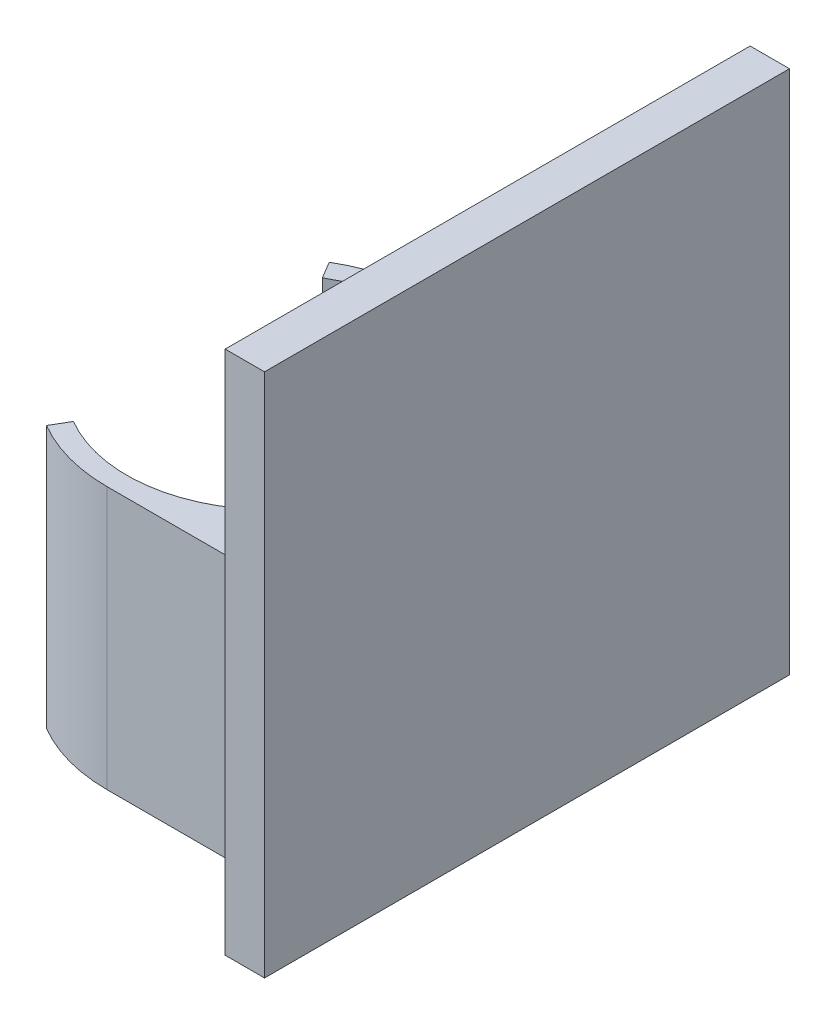
ISO-10303-21;
HEADER;
FILE_DESCRIPTION(('STEP AP214'),'2;1');
FILE_NAME('part.step','',(''),(''),'','','');
FILE_SCHEMA(('AUTOMOTIVE_DESIGN { 1 0 10303 214 1 1 1 1 }'));
ENDSEC;
DATA;
#1=APPLICATION_CONTEXT('core data for automotive mechanical design processes');
#2=APPLICATION_PROTOCOL_DEFINITION('international standard','automotive_design',2000,#1);
#3=PRODUCT_CONTEXT('',#1,'mechanical');
#4=PRODUCT('Part','Part','',(#3));
#5=PRODUCT_RELATED_PRODUCT_CATEGORY('part','',(#4));
#6=PRODUCT_DEFINITION_FORMATION('','',#4);
#7=PRODUCT_DEFINITION_CONTEXT('part definition',#1,'design');
#8=PRODUCT_DEFINITION('design','',#6,#7);
#9=PRODUCT_DEFINITION_SHAPE('','',#8);
#10=(LENGTH_UNIT() NAMED_UNIT(*) SI_UNIT(.MILLI.,.METRE.));
#11=(NAMED_UNIT(*) PLANE_ANGLE_UNIT() SI_UNIT($,.RADIAN.));
#12=(NAMED_UNIT(*) SI_UNIT($,.STERADIAN.) SOLID_ANGLE_UNIT());
#13=UNCERTAINTY_MEASURE_WITH_UNIT(LENGTH_MEASURE(1.E-05),#10,'distance_accuracy_value','');
#14=(GEOMETRIC_REPRESENTATION_CONTEXT(3) GLOBAL_UNCERTAINTY_ASSIGNED_CONTEXT((#13)) GLOBAL_UNIT_ASSIGNED_CONTEXT((#10,
#11,#12)) REPRESENTATION_CONTEXT('',''));
#15=CARTESIAN_POINT('',(0.,0.,0.));
#16=DIRECTION('',(0.,0.,1.));
#17=DIRECTION('',(1.,0.,0.));
#18=AXIS2_PLACEMENT_3D('',#15,#16,#17);
#19=CARTESIAN_POINT('',(19.5,1.07508098216747,-20.));
#20=DIRECTION('',(0.,0.,1.));
#21=DIRECTION('',(1.,0.,0.));
#22=AXIS2_PLACEMENT_3D('',#19,#20,#21);
#23=PLANE('',#22);
#24=DIRECTION('',(0.,1.,0.));
#25=VECTOR('',#24,1.);
#26=CARTESIAN_POINT('',(16.5,1.07508098216747,-20.));
#27=LINE('',#26,#25);
#28=CARTESIAN_POINT('',(16.5,1.07508098216747,-20.));
#29=VERTEX_POINT('',#28);
#30=CARTESIAN_POINT('',(16.5,41.0750809821675,-20.));
#31=VERTEX_POINT('',#30);
#32=EDGE_CURVE('E112',#29,#31,#27,.T.);
#33=ORIENTED_EDGE('',*,*,#32,.T.);
#34=DIRECTION('',(-1.,0.,0.));
#35=VECTOR('',#34,1.);
#36=CARTESIAN_POINT('',(19.5,41.0750809821675,-20.));
#37=LINE('',#36,#35);
#38=CARTESIAN_POINT('',(19.5,41.0750809821675,-20.));
#39=VERTEX_POINT('',#38);
#40=EDGE_CURVE('E12',#39,#31,#37,.T.);
#41=ORIENTED_EDGE('',*,*,#40,.F.);
#42=DIRECTION('',(0.,1.,0.));
#43=VECTOR('',#42,1.);
#44=CARTESIAN_POINT('',(19.5,1.07508098216747,-20.));
#45=LINE('',#44,#43);
#46=CARTESIAN_POINT('',(19.5,1.07508098216747,-20.));
#47=VERTEX_POINT('',#46);
#48=EDGE_CURVE('E100',#47,#39,#45,.T.);
#49=ORIENTED_EDGE('',*,*,#48,.F.);
#50=DIRECTION('',(-1.,0.,0.));
#51=VECTOR('',#50,1.);
#52=CARTESIAN_POINT('',(19.5,1.07508098216747,-20.));
#53=LINE('',#52,#51);
#54=EDGE_CURVE('E108',#47,#29,#53,.T.);
#55=ORIENTED_EDGE('',*,*,#54,.T.);
#56=EDGE_LOOP('',(#33,#41,#49,#55));
#57=FACE_BOUND('',#56,.T.);
#58=ADVANCED_FACE('F49',(#57),#23,.F.);
#59=CARTESIAN_POINT('',(19.5,41.0750809821675,20.));
#60=DIRECTION('',(0.,-1.,0.));
#61=DIRECTION('',(0.,0.,-1.));
#62=AXIS2_PLACEMENT_3D('',#59,#60,#61);
#63=PLANE('',#62);
#64=DIRECTION('',(0.,0.,1.));
#65=VECTOR('',#64,1.);
#66=CARTESIAN_POINT('',(16.5,41.0750809821675,20.));
#67=LINE('',#66,#65);
#68=CARTESIAN_POINT('',(16.5,41.0750809821675,20.));
#69=VERTEX_POINT('',#68);
#70=EDGE_CURVE('E104',#31,#69,#67,.T.);
#71=ORIENTED_EDGE('',*,*,#70,.T.);
#72=DIRECTION('',(-1.,0.,0.));
#73=VECTOR('',#72,1.);
#74=CARTESIAN_POINT('',(19.5,41.0750809821675,20.));
#75=LINE('',#74,#73);
#76=CARTESIAN_POINT('',(19.5,41.0750809821675,20.));
#77=VERTEX_POINT('',#76);
#78=EDGE_CURVE('E57',#77,#69,#75,.T.);
#79=ORIENTED_EDGE('',*,*,#78,.F.);
#80=DIRECTION('',(0.,0.,1.));
#81=VECTOR('',#80,1.);
#82=CARTESIAN_POINT('',(19.5,41.0750809821675,20.));
#83=LINE('',#82,#81);
#84=EDGE_CURVE('E95',#39,#77,#83,.T.);
#85=ORIENTED_EDGE('',*,*,#84,.F.);
#86=ORIENTED_EDGE('',*,*,#40,.T.);
#87=EDGE_LOOP('',(#71,#79,#85,#86));
#88=FACE_BOUND('',#87,.T.);
#89=ADVANCED_FACE('F103',(#88),#63,.F.);
#90=CARTESIAN_POINT('',(19.5,1.07508098216747,20.));
#91=DIRECTION('',(0.,0.,-1.));
#92=DIRECTION('',(-1.,0.,0.));
#93=AXIS2_PLACEMENT_3D('',#90,#91,#92);
#94=PLANE('',#93);
#95=DIRECTION('',(0.,-1.,0.));
#96=VECTOR('',#95,1.);
#97=CARTESIAN_POINT('',(16.5,1.07508098216747,20.));
#98=LINE('',#97,#96);
#99=CARTESIAN_POINT('',(16.5,1.07508098216747,20.));
#100=VERTEX_POINT('',#99);
#101=EDGE_CURVE('E82',#69,#100,#98,.T.);
#102=ORIENTED_EDGE('',*,*,#101,.T.);
#103=DIRECTION('',(-1.,0.,0.));
#104=VECTOR('',#103,1.);
#105=CARTESIAN_POINT('',(19.5,1.07508098216747,20.));
#106=LINE('',#105,#104);
#107=CARTESIAN_POINT('',(19.5,1.07508098216747,20.));
#108=VERTEX_POINT('',#107);
#109=EDGE_CURVE('E105',#108,#100,#106,.T.);
#110=ORIENTED_EDGE('',*,*,#109,.F.);
#111=DIRECTION('',(0.,-1.,0.));
#112=VECTOR('',#111,1.);
#113=CARTESIAN_POINT('',(19.5,1.07508098216747,20.));
#114=LINE('',#113,#112);
#115=EDGE_CURVE('E98',#77,#108,#114,.T.);
#116=ORIENTED_EDGE('',*,*,#115,.F.);
#117=ORIENTED_EDGE('',*,*,#78,.T.);
#118=EDGE_LOOP('',(#102,#110,#116,#117));
#119=FACE_BOUND('',#118,.T.);
#120=ADVANCED_FACE('F106',(#119),#94,.F.);
#121=CARTESIAN_POINT('',(19.5,1.07508098216747,20.));
#122=DIRECTION('',(0.,1.,0.));
#123=DIRECTION('',(0.,0.,1.));
#124=AXIS2_PLACEMENT_3D('',#121,#122,#123);
#125=PLANE('',#124);
#126=DIRECTION('',(0.,0.,-1.));
#127=VECTOR('',#126,1.);
#128=CARTESIAN_POINT('',(16.5,1.07508098216747,20.));
#129=LINE('',#128,#127);
#130=EDGE_CURVE('E88',#100,#29,#129,.T.);
#131=ORIENTED_EDGE('',*,*,#130,.T.);
#132=ORIENTED_EDGE('',*,*,#54,.F.);
#133=DIRECTION('',(0.,0.,-1.));
#134=VECTOR('',#133,1.);
#135=CARTESIAN_POINT('',(19.5,1.07508098216747,20.));
#136=LINE('',#135,#134);
#137=EDGE_CURVE('E65',#108,#47,#136,.T.);
#138=ORIENTED_EDGE('',*,*,#137,.F.);
#139=ORIENTED_EDGE('',*,*,#109,.T.);
#140=EDGE_LOOP('',(#131,#132,#138,#139));
#141=FACE_BOUND('',#140,.T.);
#142=ADVANCED_FACE('F119',(#141),#125,.F.);
#143=CARTESIAN_POINT('',(19.5,0.,0.));
#144=DIRECTION('',(-1.,0.,0.));
#145=DIRECTION('',(0.,0.,1.));
#146=AXIS2_PLACEMENT_3D('',#143,#144,#145);
#147=PLANE('',#146);
#148=ORIENTED_EDGE('',*,*,#48,.T.);
#149=ORIENTED_EDGE('',*,*,#84,.T.);
#150=ORIENTED_EDGE('',*,*,#115,.T.);
#151=ORIENTED_EDGE('',*,*,#137,.T.);
#152=EDGE_LOOP('',(#148,#149,#150,#151));
#153=FACE_BOUND('',#152,.T.);
#154=ADVANCED_FACE('F96',(#153),#147,.F.);
#155=CARTESIAN_POINT('',(16.5,0.,0.));
#156=DIRECTION('',(-1.,0.,0.));
#157=DIRECTION('',(0.,0.,1.));
#158=AXIS2_PLACEMENT_3D('',#155,#156,#157);
#159=PLANE('',#158);
#160=ORIENTED_EDGE('',*,*,#32,.F.);
#161=ORIENTED_EDGE('',*,*,#130,.F.);
#162=ORIENTED_EDGE('',*,*,#101,.F.);
#163=ORIENTED_EDGE('',*,*,#70,.F.);
#164=EDGE_LOOP('',(#160,#161,#162,#163));
#165=FACE_BOUND('',#164,.T.);
#166=ADVANCED_FACE('F122',(#165),#159,.T.);
#167=CLOSED_SHELL('',(#58,#89,#120,#142,#154,#166));
#168=MANIFOLD_SOLID_BREP('B2',#167);
#169=CARTESIAN_POINT('',(-12.5,20.,-12.5));
#170=DIRECTION('',(0.,0.,1.));
#171=DIRECTION('',(1.,0.,0.));
#172=AXIS2_PLACEMENT_3D('',#169,#170,#171);
#173=PLANE('',#172);
#174=DIRECTION('',(0.,1.,0.));
#175=VECTOR('',#174,1.);
#176=CARTESIAN_POINT('',(0.,0.,-12.5));
#177=LINE('',#176,#175);
#178=CARTESIAN_POINT('',(0.,0.,-12.5));
#179=VERTEX_POINT('',#178);
#180=CARTESIAN_POINT('',(0.,20.,-12.5));
#181=VERTEX_POINT('',#180);
#182=EDGE_CURVE('E237',#179,#181,#177,.T.);
#183=ORIENTED_EDGE('',*,*,#182,.T.);
#184=DIRECTION('',(-1.,0.,0.));
#185=VECTOR('',#184,1.);
#186=CARTESIAN_POINT('',(-12.5,20.,-12.5));
#187=LINE('',#186,#185);
#188=CARTESIAN_POINT('',(12.5,20.,-12.5));
#189=VERTEX_POINT('',#188);
#190=EDGE_CURVE('E271',#189,#181,#187,.T.);
#191=ORIENTED_EDGE('',*,*,#190,.F.);
#192=DIRECTION('',(0.,-1.,0.));
#193=VECTOR('',#192,1.);
#194=CARTESIAN_POINT('',(12.5,20.,-12.5));
#195=LINE('',#194,#193);
#196=CARTESIAN_POINT('',(12.5,0.,-12.5));
#197=VERTEX_POINT('',#196);
#198=EDGE_CURVE('E47',#189,#197,#195,.T.);
#199=ORIENTED_EDGE('',*,*,#198,.T.);
#200=DIRECTION('',(-1.,0.,0.));
#201=VECTOR('',#200,1.);
#202=CARTESIAN_POINT('',(-12.5,0.,-12.5));
#203=LINE('',#202,#201);
#204=EDGE_CURVE('E251',#197,#179,#203,.T.);
#205=ORIENTED_EDGE('',*,*,#204,.T.);
#206=EDGE_LOOP('',(#183,#191,#199,#205));
#207=FACE_BOUND('',#206,.T.);
#208=ADVANCED_FACE('F172',(#207),#173,.F.);
#209=CARTESIAN_POINT('',(12.5,20.,12.5));
#210=DIRECTION('',(-1.,0.,0.));
#211=DIRECTION('',(0.,0.,1.));
#212=AXIS2_PLACEMENT_3D('',#209,#210,#211);
#213=PLANE('',#212);
#214=DIRECTION('',(0.,0.,-1.));
#215=VECTOR('',#214,1.);
#216=CARTESIAN_POINT('',(12.5,0.,12.5));
#217=LINE('',#216,#215);
#218=CARTESIAN_POINT('',(12.5,0.,12.5));
#219=VERTEX_POINT('',#218);
#220=EDGE_CURVE('E259',#219,#197,#217,.T.);
#221=ORIENTED_EDGE('',*,*,#220,.T.);
#222=ORIENTED_EDGE('',*,*,#198,.F.);
#223=DIRECTION('',(0.,0.,-1.));
#224=VECTOR('',#223,1.);
#225=CARTESIAN_POINT('',(12.5,20.,12.5));
#226=LINE('',#225,#224);
#227=CARTESIAN_POINT('',(12.5,20.,12.5));
#228=VERTEX_POINT('',#227);
#229=EDGE_CURVE('E261',#228,#189,#226,.T.);
#230=ORIENTED_EDGE('',*,*,#229,.F.);
#231=DIRECTION('',(0.,-1.,0.));
#232=VECTOR('',#231,1.);
#233=CARTESIAN_POINT('',(12.5,20.,12.5));
#234=LINE('',#233,#232);
#235=EDGE_CURVE('E180',#228,#219,#234,.T.);
#236=ORIENTED_EDGE('',*,*,#235,.T.);
#237=EDGE_LOOP('',(#221,#222,#230,#236));
#238=FACE_BOUND('',#237,.T.);
#239=ADVANCED_FACE('F174',(#238),#213,.F.);
#240=CARTESIAN_POINT('',(-12.5,20.,12.5));
#241=DIRECTION('',(0.,0.,-1.));
#242=DIRECTION('',(-1.,0.,0.));
#243=AXIS2_PLACEMENT_3D('',#240,#241,#242);
#244=PLANE('',#243);
#245=DIRECTION('',(1.,0.,0.));
#246=VECTOR('',#245,1.);
#247=CARTESIAN_POINT('',(-12.5,20.,12.5));
#248=LINE('',#247,#246);
#249=CARTESIAN_POINT('',(0.,20.,12.5));
#250=VERTEX_POINT('',#249);
#251=EDGE_CURVE('E267',#250,#228,#248,.T.);
#252=ORIENTED_EDGE('',*,*,#251,.F.);
#253=DIRECTION('',(0.,1.,0.));
#254=VECTOR('',#253,1.);
#255=CARTESIAN_POINT('',(0.,0.,12.5));
#256=LINE('',#255,#254);
#257=CARTESIAN_POINT('',(0.,0.,12.5));
#258=VERTEX_POINT('',#257);
#259=EDGE_CURVE('E246',#258,#250,#256,.T.);
#260=ORIENTED_EDGE('',*,*,#259,.F.);
#261=DIRECTION('',(1.,0.,0.));
#262=VECTOR('',#261,1.);
#263=CARTESIAN_POINT('',(-12.5,0.,12.5));
#264=LINE('',#263,#262);
#265=EDGE_CURVE('E258',#258,#219,#264,.T.);
#266=ORIENTED_EDGE('',*,*,#265,.T.);
#267=ORIENTED_EDGE('',*,*,#235,.F.);
#268=EDGE_LOOP('',(#252,#260,#266,#267));
#269=FACE_BOUND('',#268,.T.);
#270=ADVANCED_FACE('F311',(#269),#244,.F.);
#271=CARTESIAN_POINT('',(0.,20.,0.));
#272=DIRECTION('',(0.,-1.,0.));
#273=DIRECTION('',(0.,0.,-1.));
#274=AXIS2_PLACEMENT_3D('',#271,#272,#273);
#275=PLANE('',#274);
#276=ORIENTED_EDGE('',*,*,#190,.T.);
#277=CARTESIAN_POINT('',(0.,20.,0.));
#278=DIRECTION('',(0.,-1.,0.));
#279=DIRECTION('',(0.,0.,1.));
#280=AXIS2_PLACEMENT_3D('',#277,#278,#279);
#281=CIRCLE('',#280,12.5);
#282=CARTESIAN_POINT('',(-6.33991603022562,20.,-10.772904191985));
#283=VERTEX_POINT('',#282);
#284=EDGE_CURVE('E242',#283,#181,#281,.T.);
#285=ORIENTED_EDGE('',*,*,#284,.F.);
#286=DIRECTION('',(-0.507193282418049,0.,-0.861832335358801));
#287=VECTOR('',#286,1.);
#288=CARTESIAN_POINT('',(-6.33991603022562,20.,-10.772904191985));
#289=LINE('',#288,#287);
#290=CARTESIAN_POINT('',(-5.57912610659854,20.,-9.48015568894681));
#291=VERTEX_POINT('',#290);
#292=EDGE_CURVE('E254',#291,#283,#289,.T.);
#293=ORIENTED_EDGE('',*,*,#292,.F.);
#294=CARTESIAN_POINT('',(0.,20.,0.));
#295=DIRECTION('',(0.,1.,0.));
#296=DIRECTION('',(0.,0.,1.));
#297=AXIS2_PLACEMENT_3D('',#294,#295,#296);
#298=CIRCLE('',#297,11.);
#299=CARTESIAN_POINT('',(-5.57912610659854,20.,9.48015568894681));
#300=VERTEX_POINT('',#299);
#301=EDGE_CURVE('E279',#300,#291,#298,.T.);
#302=ORIENTED_EDGE('',*,*,#301,.F.);
#303=DIRECTION('',(0.50719328241805,0.,-0.861832335358801));
#304=VECTOR('',#303,1.);
#305=CARTESIAN_POINT('',(-6.33991603022562,20.,10.772904191985));
#306=LINE('',#305,#304);
#307=CARTESIAN_POINT('',(-6.33991603022562,20.,10.772904191985));
#308=VERTEX_POINT('',#307);
#309=EDGE_CURVE('E187',#308,#300,#306,.T.);
#310=ORIENTED_EDGE('',*,*,#309,.F.);
#311=CARTESIAN_POINT('',(0.,20.,0.));
#312=DIRECTION('',(0.,-1.,0.));
#313=DIRECTION('',(0.,0.,1.));
#314=AXIS2_PLACEMENT_3D('',#311,#312,#313);
#315=CIRCLE('',#314,12.5);
#316=EDGE_CURVE('E295',#250,#308,#315,.T.);
#317=ORIENTED_EDGE('',*,*,#316,.F.);
#318=ORIENTED_EDGE('',*,*,#251,.T.);
#319=ORIENTED_EDGE('',*,*,#229,.T.);
#320=EDGE_LOOP('',(#276,#285,#293,#302,#310,#317,#318,#319));
#321=FACE_BOUND('',#320,.T.);
#322=ADVANCED_FACE('F312',(#321),#275,.F.);
#323=CARTESIAN_POINT('',(0.,0.,0.));
#324=DIRECTION('',(0.,-1.,0.));
#325=DIRECTION('',(0.,0.,-1.));
#326=AXIS2_PLACEMENT_3D('',#323,#324,#325);
#327=PLANE('',#326);
#328=CARTESIAN_POINT('',(0.,0.,0.));
#329=DIRECTION('',(0.,-1.,0.));
#330=DIRECTION('',(0.,0.,1.));
#331=AXIS2_PLACEMENT_3D('',#328,#329,#330);
#332=CIRCLE('',#331,12.5);
#333=CARTESIAN_POINT('',(-6.33991603022562,0.,-10.772904191985));
#334=VERTEX_POINT('',#333);
#335=EDGE_CURVE('E240',#334,#179,#332,.T.);
#336=ORIENTED_EDGE('',*,*,#335,.T.);
#337=ORIENTED_EDGE('',*,*,#204,.F.);
#338=ORIENTED_EDGE('',*,*,#220,.F.);
#339=ORIENTED_EDGE('',*,*,#265,.F.);
#340=CARTESIAN_POINT('',(0.,0.,0.));
#341=DIRECTION('',(0.,-1.,0.));
#342=DIRECTION('',(0.,0.,1.));
#343=AXIS2_PLACEMENT_3D('',#340,#341,#342);
#344=CIRCLE('',#343,12.5);
#345=CARTESIAN_POINT('',(-6.33991603022562,0.,10.772904191985));
#346=VERTEX_POINT('',#345);
#347=EDGE_CURVE('E253',#258,#346,#344,.T.);
#348=ORIENTED_EDGE('',*,*,#347,.T.);
#349=DIRECTION('',(0.50719328241805,0.,-0.861832335358801));
#350=VECTOR('',#349,1.);
#351=CARTESIAN_POINT('',(-6.33991603022562,0.,10.772904191985));
#352=LINE('',#351,#350);
#353=CARTESIAN_POINT('',(-5.57912610659854,0.,9.48015568894681));
#354=VERTEX_POINT('',#353);
#355=EDGE_CURVE('E300',#346,#354,#352,.T.);
#356=ORIENTED_EDGE('',*,*,#355,.T.);
#357=CARTESIAN_POINT('',(0.,0.,0.));
#358=DIRECTION('',(0.,1.,0.));
#359=DIRECTION('',(0.,0.,1.));
#360=AXIS2_PLACEMENT_3D('',#357,#358,#359);
#361=CIRCLE('',#360,11.);
#362=CARTESIAN_POINT('',(-5.57912610659854,0.,-9.48015568894681));
#363=VERTEX_POINT('',#362);
#364=EDGE_CURVE('E263',#354,#363,#361,.T.);
#365=ORIENTED_EDGE('',*,*,#364,.T.);
#366=DIRECTION('',(-0.507193282418049,0.,-0.861832335358801));
#367=VECTOR('',#366,1.);
#368=CARTESIAN_POINT('',(-6.33991603022562,0.,-10.772904191985));
#369=LINE('',#368,#367);
#370=EDGE_CURVE('E195',#363,#334,#369,.T.);
#371=ORIENTED_EDGE('',*,*,#370,.T.);
#372=EDGE_LOOP('',(#336,#337,#338,#339,#348,#356,#365,#371));
#373=FACE_BOUND('',#372,.T.);
#374=ADVANCED_FACE('F249',(#373),#327,.T.);
#375=CARTESIAN_POINT('',(0.,0.,0.));
#376=DIRECTION('',(0.,1.,0.));
#377=DIRECTION('',(0.,0.,1.));
#378=AXIS2_PLACEMENT_3D('',#375,#376,#377);
#379=CYLINDRICAL_SURFACE('',#378,11.);
#380=ORIENTED_EDGE('',*,*,#301,.T.);
#381=DIRECTION('',(0.,1.,0.));
#382=VECTOR('',#381,1.);
#383=CARTESIAN_POINT('',(-5.57912610659854,0.,-9.48015568894681));
#384=LINE('',#383,#382);
#385=EDGE_CURVE('E289',#363,#291,#384,.T.);
#386=ORIENTED_EDGE('',*,*,#385,.F.);
#387=ORIENTED_EDGE('',*,*,#364,.F.);
#388=DIRECTION('',(0.,1.,0.));
#389=VECTOR('',#388,1.);
#390=CARTESIAN_POINT('',(-5.57912610659854,0.,9.48015568894681));
#391=LINE('',#390,#389);
#392=EDGE_CURVE('E287',#354,#300,#391,.T.);
#393=ORIENTED_EDGE('',*,*,#392,.T.);
#394=EDGE_LOOP('',(#380,#386,#387,#393));
#395=FACE_BOUND('',#394,.T.);
#396=ADVANCED_FACE('F316',(#395),#379,.F.);
#397=CARTESIAN_POINT('',(-6.33991603022562,0.,10.772904191985));
#398=DIRECTION('',(0.861832335358801,0.,0.50719328241805));
#399=DIRECTION('',(0.50719328241805,0.,-0.861832335358801));
#400=AXIS2_PLACEMENT_3D('',#397,#398,#399);
#401=PLANE('',#400);
#402=ORIENTED_EDGE('',*,*,#309,.T.);
#403=ORIENTED_EDGE('',*,*,#392,.F.);
#404=ORIENTED_EDGE('',*,*,#355,.F.);
#405=DIRECTION('',(0.,1.,0.));
#406=VECTOR('',#405,1.);
#407=CARTESIAN_POINT('',(-6.33991603022562,0.,10.772904191985));
#408=LINE('',#407,#406);
#409=EDGE_CURVE('E285',#346,#308,#408,.T.);
#410=ORIENTED_EDGE('',*,*,#409,.T.);
#411=EDGE_LOOP('',(#402,#403,#404,#410));
#412=FACE_BOUND('',#411,.T.);
#413=ADVANCED_FACE('F317',(#412),#401,.F.);
#414=CARTESIAN_POINT('',(0.,0.,0.));
#415=DIRECTION('',(0.,1.,0.));
#416=DIRECTION('',(0.,0.,1.));
#417=AXIS2_PLACEMENT_3D('',#414,#415,#416);
#418=CYLINDRICAL_SURFACE('',#417,12.5);
#419=ORIENTED_EDGE('',*,*,#316,.T.);
#420=ORIENTED_EDGE('',*,*,#409,.F.);
#421=ORIENTED_EDGE('',*,*,#347,.F.);
#422=ORIENTED_EDGE('',*,*,#259,.T.);
#423=EDGE_LOOP('',(#419,#420,#421,#422));
#424=FACE_BOUND('',#423,.T.);
#425=ADVANCED_FACE('F309',(#424),#418,.T.);
#426=CARTESIAN_POINT('',(0.,0.,0.));
#427=DIRECTION('',(0.,1.,0.));
#428=DIRECTION('',(0.,0.,1.));
#429=AXIS2_PLACEMENT_3D('',#426,#427,#428);
#430=CYLINDRICAL_SURFACE('',#429,12.5);
#431=ORIENTED_EDGE('',*,*,#284,.T.);
#432=ORIENTED_EDGE('',*,*,#182,.F.);
#433=ORIENTED_EDGE('',*,*,#335,.F.);
#434=DIRECTION('',(0.,1.,0.));
#435=VECTOR('',#434,1.);
#436=CARTESIAN_POINT('',(-6.33991603022562,0.,-10.772904191985));
#437=LINE('',#436,#435);
#438=EDGE_CURVE('E282',#334,#283,#437,.T.);
#439=ORIENTED_EDGE('',*,*,#438,.T.);
#440=EDGE_LOOP('',(#431,#432,#433,#439));
#441=FACE_BOUND('',#440,.T.);
#442=ADVANCED_FACE('F239',(#441),#430,.T.);
#443=CARTESIAN_POINT('',(-6.33991603022562,0.,-10.772904191985));
#444=DIRECTION('',(0.861832335358801,0.,-0.507193282418049));
#445=DIRECTION('',(-0.507193282418049,0.,-0.861832335358801));
#446=AXIS2_PLACEMENT_3D('',#443,#444,#445);
#447=PLANE('',#446);
#448=ORIENTED_EDGE('',*,*,#292,.T.);
#449=ORIENTED_EDGE('',*,*,#438,.F.);
#450=ORIENTED_EDGE('',*,*,#370,.F.);
#451=ORIENTED_EDGE('',*,*,#385,.T.);
#452=EDGE_LOOP('',(#448,#449,#450,#451));
#453=FACE_BOUND('',#452,.T.);
#454=ADVANCED_FACE('F339',(#453),#447,.F.);
#455=CLOSED_SHELL('',(#208,#239,#270,#322,#374,#396,#413,#425,#442,#454));
#456=MANIFOLD_SOLID_BREP('B6',#455);
#457=ADVANCED_BREP_SHAPE_REPRESENTATION('',(#18,#168,#456),#14);
#458=SHAPE_DEFINITION_REPRESENTATION(#9,#457);
ENDSEC;
END-ISO-10303-21;
